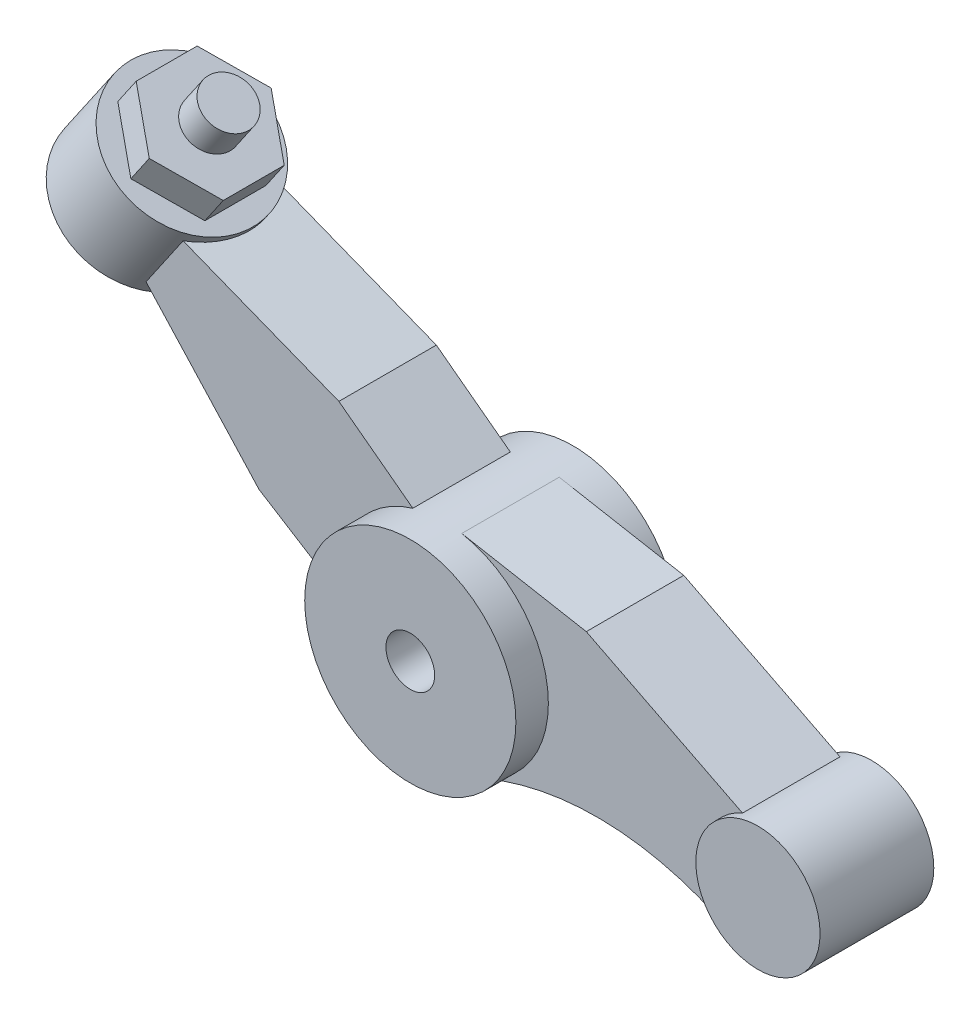
ISO-10303-21;
HEADER;
FILE_DESCRIPTION(('STEP AP214'),'2;1');
FILE_NAME('part.step','',(''),(''),'','','');
FILE_SCHEMA(('AUTOMOTIVE_DESIGN { 1 0 10303 214 1 1 1 1 }'));
ENDSEC;
DATA;
#1=APPLICATION_CONTEXT('core data for automotive mechanical design processes');
#2=APPLICATION_PROTOCOL_DEFINITION('international standard','automotive_design',2000,#1);
#3=PRODUCT_CONTEXT('',#1,'mechanical');
#4=PRODUCT('Part','Part','',(#3));
#5=PRODUCT_RELATED_PRODUCT_CATEGORY('part','',(#4));
#6=PRODUCT_DEFINITION_FORMATION('','',#4);
#7=PRODUCT_DEFINITION_CONTEXT('part definition',#1,'design');
#8=PRODUCT_DEFINITION('design','',#6,#7);
#9=PRODUCT_DEFINITION_SHAPE('','',#8);
#10=(LENGTH_UNIT() NAMED_UNIT(*) SI_UNIT(.MILLI.,.METRE.));
#11=(NAMED_UNIT(*) PLANE_ANGLE_UNIT() SI_UNIT($,.RADIAN.));
#12=(NAMED_UNIT(*) SI_UNIT($,.STERADIAN.) SOLID_ANGLE_UNIT());
#13=UNCERTAINTY_MEASURE_WITH_UNIT(LENGTH_MEASURE(1.E-05),#10,'distance_accuracy_value','');
#14=(GEOMETRIC_REPRESENTATION_CONTEXT(3) GLOBAL_UNCERTAINTY_ASSIGNED_CONTEXT((#13)) GLOBAL_UNIT_ASSIGNED_CONTEXT((#10,
#11,#12)) REPRESENTATION_CONTEXT('',''));
#15=CARTESIAN_POINT('',(0.,0.,0.));
#16=DIRECTION('',(0.,0.,1.));
#17=DIRECTION('',(1.,0.,0.));
#18=AXIS2_PLACEMENT_3D('',#15,#16,#17);
#19=CARTESIAN_POINT('',(0.,0.,1.));
#20=DIRECTION('',(0.,0.,-1.));
#21=DIRECTION('',(-1.,0.,0.));
#22=AXIS2_PLACEMENT_3D('',#19,#20,#21);
#23=CYLINDRICAL_SURFACE('',#22,0.3);
#24=CARTESIAN_POINT('',(0.,0.,1.));
#25=DIRECTION('',(0.,0.,1.));
#26=DIRECTION('',(1.,0.,0.));
#27=AXIS2_PLACEMENT_3D('',#24,#25,#26);
#28=CIRCLE('',#27,0.3);
#29=CARTESIAN_POINT('',(0.3,0.,1.));
#30=VERTEX_POINT('',#29);
#31=EDGE_CURVE('E280',#30,#30,#28,.T.);
#32=ORIENTED_EDGE('',*,*,#31,.T.);
#33=EDGE_LOOP('',(#32));
#34=FACE_BOUND('',#33,.T.);
#35=CARTESIAN_POINT('',(0.,0.,-1.));
#36=DIRECTION('',(0.,0.,1.));
#37=DIRECTION('',(1.,0.,0.));
#38=AXIS2_PLACEMENT_3D('',#35,#36,#37);
#39=CIRCLE('',#38,0.3);
#40=CARTESIAN_POINT('',(0.3,0.,-1.));
#41=VERTEX_POINT('',#40);
#42=EDGE_CURVE('E279',#41,#41,#39,.T.);
#43=ORIENTED_EDGE('',*,*,#42,.F.);
#44=EDGE_LOOP('',(#43));
#45=FACE_BOUND('',#44,.T.);
#46=ADVANCED_FACE('F37',(#34,#45),#23,.F.);
#47=CARTESIAN_POINT('',(0.,0.,1.));
#48=DIRECTION('',(0.,0.,-1.));
#49=DIRECTION('',(-1.,0.,0.));
#50=AXIS2_PLACEMENT_3D('',#47,#48,#49);
#51=CYLINDRICAL_SURFACE('',#50,1.3);
#52=DIRECTION('',(0.,0.,-1.));
#53=VECTOR('',#52,1.);
#54=CARTESIAN_POINT('',(-0.368782160994087,1.24659525016444,0.6));
#55=LINE('',#54,#53);
#56=CARTESIAN_POINT('',(-0.368782160994086,1.24659525016444,0.6));
#57=VERTEX_POINT('',#56);
#58=CARTESIAN_POINT('',(-0.368782160994086,1.24659525016444,-0.6));
#59=VERTEX_POINT('',#58);
#60=EDGE_CURVE('E231',#57,#59,#55,.T.);
#61=ORIENTED_EDGE('',*,*,#60,.F.);
#62=CARTESIAN_POINT('',(0.,0.,0.6));
#63=DIRECTION('',(0.,0.,1.));
#64=DIRECTION('',(1.,0.,0.));
#65=AXIS2_PLACEMENT_3D('',#62,#63,#64);
#66=CIRCLE('',#65,1.3);
#67=CARTESIAN_POINT('',(-1.29584863415519,-0.103809042756995,0.6));
#68=VERTEX_POINT('',#67);
#69=EDGE_CURVE('E199',#57,#68,#66,.T.);
#70=ORIENTED_EDGE('',*,*,#69,.T.);
#71=DIRECTION('',(0.,0.,-1.));
#72=VECTOR('',#71,1.);
#73=CARTESIAN_POINT('',(-1.29584863415519,-0.103809042756996,0.6));
#74=LINE('',#73,#72);
#75=CARTESIAN_POINT('',(-1.29584863415519,-0.103809042756996,-0.6));
#76=VERTEX_POINT('',#75);
#77=EDGE_CURVE('E212',#68,#76,#74,.T.);
#78=ORIENTED_EDGE('',*,*,#77,.T.);
#79=CARTESIAN_POINT('',(0.,0.,-0.6));
#80=DIRECTION('',(0.,0.,1.));
#81=DIRECTION('',(1.,0.,0.));
#82=AXIS2_PLACEMENT_3D('',#79,#80,#81);
#83=CIRCLE('',#82,1.3);
#84=EDGE_CURVE('E198',#59,#76,#83,.T.);
#85=ORIENTED_EDGE('',*,*,#84,.F.);
#86=EDGE_LOOP('',(#61,#70,#78,#85));
#87=FACE_BOUND('',#86,.T.);
#88=DIRECTION('',(0.,0.,-1.));
#89=VECTOR('',#88,1.);
#90=CARTESIAN_POINT('',(0.510625375488259,-1.19551734655231,0.6));
#91=LINE('',#90,#89);
#92=CARTESIAN_POINT('',(0.510625375488259,-1.19551734655231,0.6));
#93=VERTEX_POINT('',#92);
#94=CARTESIAN_POINT('',(0.510625375488259,-1.19551734655231,-0.6));
#95=VERTEX_POINT('',#94);
#96=EDGE_CURVE('E254',#93,#95,#91,.T.);
#97=ORIENTED_EDGE('',*,*,#96,.F.);
#98=CARTESIAN_POINT('',(0.,0.,0.6));
#99=DIRECTION('',(0.,0.,1.));
#100=DIRECTION('',(1.,0.,0.));
#101=AXIS2_PLACEMENT_3D('',#98,#99,#100);
#102=CIRCLE('',#101,1.3);
#103=CARTESIAN_POINT('',(0.233288639489459,1.2788965598066,0.6));
#104=VERTEX_POINT('',#103);
#105=EDGE_CURVE('E252',#93,#104,#102,.T.);
#106=ORIENTED_EDGE('',*,*,#105,.T.);
#107=DIRECTION('',(0.,0.,-1.));
#108=VECTOR('',#107,1.);
#109=CARTESIAN_POINT('',(0.233288639489459,1.2788965598066,0.6));
#110=LINE('',#109,#108);
#111=CARTESIAN_POINT('',(0.233288639489459,1.2788965598066,-0.6));
#112=VERTEX_POINT('',#111);
#113=EDGE_CURVE('E269',#104,#112,#110,.T.);
#114=ORIENTED_EDGE('',*,*,#113,.T.);
#115=CARTESIAN_POINT('',(0.,0.,-0.6));
#116=DIRECTION('',(0.,0.,1.));
#117=DIRECTION('',(1.,0.,0.));
#118=AXIS2_PLACEMENT_3D('',#115,#116,#117);
#119=CIRCLE('',#118,1.3);
#120=EDGE_CURVE('E245',#95,#112,#119,.T.);
#121=ORIENTED_EDGE('',*,*,#120,.F.);
#122=EDGE_LOOP('',(#97,#106,#114,#121));
#123=FACE_BOUND('',#122,.T.);
#124=CARTESIAN_POINT('',(0.,0.,1.));
#125=DIRECTION('',(0.,0.,1.));
#126=DIRECTION('',(1.,0.,0.));
#127=AXIS2_PLACEMENT_3D('',#124,#125,#126);
#128=CIRCLE('',#127,1.3);
#129=CARTESIAN_POINT('',(1.3,0.,1.));
#130=VERTEX_POINT('',#129);
#131=EDGE_CURVE('E283',#130,#130,#128,.T.);
#132=ORIENTED_EDGE('',*,*,#131,.F.);
#133=EDGE_LOOP('',(#132));
#134=FACE_BOUND('',#133,.T.);
#135=CARTESIAN_POINT('',(0.,0.,-1.));
#136=DIRECTION('',(0.,0.,1.));
#137=DIRECTION('',(1.,0.,0.));
#138=AXIS2_PLACEMENT_3D('',#135,#136,#137);
#139=CIRCLE('',#138,1.3);
#140=CARTESIAN_POINT('',(1.3,0.,-1.));
#141=VERTEX_POINT('',#140);
#142=EDGE_CURVE('E284',#141,#141,#139,.T.);
#143=ORIENTED_EDGE('',*,*,#142,.T.);
#144=EDGE_LOOP('',(#143));
#145=FACE_BOUND('',#144,.T.);
#146=ADVANCED_FACE('F307',(#87,#123,#134,#145),#51,.T.);
#147=CARTESIAN_POINT('',(0.,0.,1.));
#148=DIRECTION('',(0.,0.,1.));
#149=DIRECTION('',(1.,0.,0.));
#150=AXIS2_PLACEMENT_3D('',#147,#148,#149);
#151=PLANE('',#150);
#152=ORIENTED_EDGE('',*,*,#31,.F.);
#153=EDGE_LOOP('',(#152));
#154=FACE_BOUND('',#153,.T.);
#155=ORIENTED_EDGE('',*,*,#131,.T.);
#156=EDGE_LOOP('',(#155));
#157=FACE_BOUND('',#156,.T.);
#158=ADVANCED_FACE('F338',(#154,#157),#151,.T.);
#159=CARTESIAN_POINT('',(0.,0.,-1.));
#160=DIRECTION('',(0.,0.,1.));
#161=DIRECTION('',(1.,0.,0.));
#162=AXIS2_PLACEMENT_3D('',#159,#160,#161);
#163=PLANE('',#162);
#164=ORIENTED_EDGE('',*,*,#42,.T.);
#165=EDGE_LOOP('',(#164));
#166=FACE_BOUND('',#165,.T.);
#167=ORIENTED_EDGE('',*,*,#142,.F.);
#168=EDGE_LOOP('',(#167));
#169=FACE_BOUND('',#168,.T.);
#170=ADVANCED_FACE('F343',(#166,#169),#163,.F.);
#171=CARTESIAN_POINT('',(1.90085393647688,-4.45043267218632,0.6));
#172=DIRECTION('',(0.,0.,-1.));
#173=DIRECTION('',(-1.,0.,0.));
#174=AXIS2_PLACEMENT_3D('',#171,#172,#173);
#175=CYLINDRICAL_SURFACE('',#174,3.53937978024903);
#176=CARTESIAN_POINT('',(1.90085393647688,-4.45043267218632,-0.6));
#177=DIRECTION('',(0.,0.,1.));
#178=DIRECTION('',(1.,0.,0.));
#179=AXIS2_PLACEMENT_3D('',#176,#177,#178);
#180=CIRCLE('',#179,3.53937978024903);
#181=CARTESIAN_POINT('',(3.59011599949996,-1.34019105596634,-0.6));
#182=VERTEX_POINT('',#181);
#183=EDGE_CURVE('E238',#182,#95,#180,.T.);
#184=ORIENTED_EDGE('',*,*,#183,.F.);
#185=DIRECTION('',(0.,0.,-1.));
#186=VECTOR('',#185,1.);
#187=CARTESIAN_POINT('',(3.59011599949996,-1.34019105596634,0.6));
#188=LINE('',#187,#186);
#189=CARTESIAN_POINT('',(3.59011599949994,-1.34019105596633,0.6));
#190=VERTEX_POINT('',#189);
#191=EDGE_CURVE('E277',#190,#182,#188,.T.);
#192=ORIENTED_EDGE('',*,*,#191,.F.);
#193=CARTESIAN_POINT('',(1.90085393647688,-4.45043267218632,0.6));
#194=DIRECTION('',(0.,0.,1.));
#195=DIRECTION('',(1.,0.,0.));
#196=AXIS2_PLACEMENT_3D('',#193,#194,#195);
#197=CIRCLE('',#196,3.53937978024903);
#198=EDGE_CURVE('E241',#190,#93,#197,.T.);
#199=ORIENTED_EDGE('',*,*,#198,.T.);
#200=ORIENTED_EDGE('',*,*,#96,.T.);
#201=EDGE_LOOP('',(#184,#192,#199,#200));
#202=FACE_BOUND('',#201,.T.);
#203=ADVANCED_FACE('F346',(#202),#175,.F.);
#204=CARTESIAN_POINT('',(0.76254825738098,1.50721358110787,0.6));
#205=DIRECTION('',(-0.451443400680883,-0.89229975679795,0.));
#206=DIRECTION('',(0.89229975679795,-0.451443400680883,0.));
#207=AXIS2_PLACEMENT_3D('',#204,#205,#206);
#208=PLANE('',#207);
#209=DIRECTION('',(-0.89229975679795,0.451443400680883,0.));
#210=VECTOR('',#209,1.);
#211=CARTESIAN_POINT('',(0.76254825738098,1.50721358110787,-0.6));
#212=LINE('',#211,#210);
#213=CARTESIAN_POINT('',(3.69023915754047,0.0259997557747794,-0.6));
#214=VERTEX_POINT('',#213);
#215=CARTESIAN_POINT('',(1.76669930267283,0.999180984180394,-0.6));
#216=VERTEX_POINT('',#215);
#217=EDGE_CURVE('E260',#214,#216,#212,.T.);
#218=ORIENTED_EDGE('',*,*,#217,.T.);
#219=DIRECTION('',(0.,0.,-1.));
#220=VECTOR('',#219,1.);
#221=CARTESIAN_POINT('',(1.76669930267283,0.999180984180394,0.6));
#222=LINE('',#221,#220);
#223=CARTESIAN_POINT('',(1.76669930267283,0.999180984180394,0.6));
#224=VERTEX_POINT('',#223);
#225=EDGE_CURVE('E271',#224,#216,#222,.T.);
#226=ORIENTED_EDGE('',*,*,#225,.F.);
#227=DIRECTION('',(-0.89229975679795,0.451443400680883,0.));
#228=VECTOR('',#227,1.);
#229=CARTESIAN_POINT('',(0.76254825738098,1.50721358110787,0.6));
#230=LINE('',#229,#228);
#231=CARTESIAN_POINT('',(3.69023915754047,0.0259997557747791,0.6));
#232=VERTEX_POINT('',#231);
#233=EDGE_CURVE('E247',#232,#224,#230,.T.);
#234=ORIENTED_EDGE('',*,*,#233,.F.);
#235=DIRECTION('',(0.,0.,-1.));
#236=VECTOR('',#235,1.);
#237=CARTESIAN_POINT('',(3.69023915754047,0.0259997557747792,0.6));
#238=LINE('',#237,#236);
#239=EDGE_CURVE('E274',#232,#214,#238,.T.);
#240=ORIENTED_EDGE('',*,*,#239,.T.);
#241=EDGE_LOOP('',(#218,#226,#234,#240));
#242=FACE_BOUND('',#241,.T.);
#243=ADVANCED_FACE('F354',(#242),#208,.F.);
#244=CARTESIAN_POINT('',(0.233288639489459,1.2788965598066,0.6));
#245=DIRECTION('',(-0.179452799607276,-0.983766584466616,0.));
#246=DIRECTION('',(0.983766584466616,-0.179452799607276,0.));
#247=AXIS2_PLACEMENT_3D('',#244,#245,#246);
#248=PLANE('',#247);
#249=DIRECTION('',(-0.983766584466616,0.179452799607276,0.));
#250=VECTOR('',#249,1.);
#251=CARTESIAN_POINT('',(0.233288639489459,1.2788965598066,-0.6));
#252=LINE('',#251,#250);
#253=EDGE_CURVE('E262',#216,#112,#252,.T.);
#254=ORIENTED_EDGE('',*,*,#253,.T.);
#255=ORIENTED_EDGE('',*,*,#113,.F.);
#256=DIRECTION('',(-0.983766584466616,0.179452799607276,0.));
#257=VECTOR('',#256,1.);
#258=CARTESIAN_POINT('',(0.233288639489459,1.2788965598066,0.6));
#259=LINE('',#258,#257);
#260=EDGE_CURVE('E249',#224,#104,#259,.T.);
#261=ORIENTED_EDGE('',*,*,#260,.F.);
#262=ORIENTED_EDGE('',*,*,#225,.T.);
#263=EDGE_LOOP('',(#254,#255,#261,#262));
#264=FACE_BOUND('',#263,.T.);
#265=ADVANCED_FACE('F362',(#264),#248,.F.);
#266=CARTESIAN_POINT('',(0.,0.,0.6));
#267=DIRECTION('',(0.,0.,1.));
#268=DIRECTION('',(1.,0.,0.));
#269=AXIS2_PLACEMENT_3D('',#266,#267,#268);
#270=PLANE('',#269);
#271=ORIENTED_EDGE('',*,*,#198,.F.);
#272=CARTESIAN_POINT('',(3.98,-0.682,0.6));
#273=DIRECTION('',(0.,0.,1.));
#274=DIRECTION('',(1.,0.,0.));
#275=AXIS2_PLACEMENT_3D('',#272,#273,#274);
#276=CIRCLE('',#275,0.765);
#277=EDGE_CURVE('E244',#232,#190,#276,.T.);
#278=ORIENTED_EDGE('',*,*,#277,.F.);
#279=ORIENTED_EDGE('',*,*,#233,.T.);
#280=ORIENTED_EDGE('',*,*,#260,.T.);
#281=ORIENTED_EDGE('',*,*,#105,.F.);
#282=EDGE_LOOP('',(#271,#278,#279,#280,#281));
#283=FACE_BOUND('',#282,.T.);
#284=ADVANCED_FACE('F366',(#283),#270,.T.);
#285=CARTESIAN_POINT('',(0.,0.,-0.6));
#286=DIRECTION('',(0.,0.,1.));
#287=DIRECTION('',(1.,0.,0.));
#288=AXIS2_PLACEMENT_3D('',#285,#286,#287);
#289=PLANE('',#288);
#290=ORIENTED_EDGE('',*,*,#183,.T.);
#291=ORIENTED_EDGE('',*,*,#120,.T.);
#292=ORIENTED_EDGE('',*,*,#253,.F.);
#293=ORIENTED_EDGE('',*,*,#217,.F.);
#294=CARTESIAN_POINT('',(3.98,-0.682,-0.6));
#295=DIRECTION('',(0.,0.,1.));
#296=DIRECTION('',(1.,0.,0.));
#297=AXIS2_PLACEMENT_3D('',#294,#295,#296);
#298=CIRCLE('',#297,0.765);
#299=EDGE_CURVE('E257',#214,#182,#298,.T.);
#300=ORIENTED_EDGE('',*,*,#299,.T.);
#301=EDGE_LOOP('',(#290,#291,#292,#293,#300));
#302=FACE_BOUND('',#301,.T.);
#303=ADVANCED_FACE('F368',(#302),#289,.F.);
#304=CARTESIAN_POINT('',(3.98,-0.682,0.7));
#305=DIRECTION('',(0.,0.,-1.));
#306=DIRECTION('',(-1.,0.,0.));
#307=AXIS2_PLACEMENT_3D('',#304,#305,#306);
#308=CYLINDRICAL_SURFACE('',#307,0.765);
#309=ORIENTED_EDGE('',*,*,#277,.T.);
#310=ORIENTED_EDGE('',*,*,#191,.T.);
#311=ORIENTED_EDGE('',*,*,#299,.F.);
#312=ORIENTED_EDGE('',*,*,#239,.F.);
#313=EDGE_LOOP('',(#309,#310,#311,#312));
#314=FACE_BOUND('',#313,.T.);
#315=CARTESIAN_POINT('',(3.98,-0.682,0.7));
#316=DIRECTION('',(0.,0.,1.));
#317=DIRECTION('',(1.,0.,0.));
#318=AXIS2_PLACEMENT_3D('',#315,#316,#317);
#319=CIRCLE('',#318,0.765);
#320=CARTESIAN_POINT('',(4.745,-0.682,0.7));
#321=VERTEX_POINT('',#320);
#322=EDGE_CURVE('E235',#321,#321,#319,.T.);
#323=ORIENTED_EDGE('',*,*,#322,.F.);
#324=EDGE_LOOP('',(#323));
#325=FACE_BOUND('',#324,.T.);
#326=CARTESIAN_POINT('',(3.98,-0.682,-0.7));
#327=DIRECTION('',(0.,0.,1.));
#328=DIRECTION('',(1.,0.,0.));
#329=AXIS2_PLACEMENT_3D('',#326,#327,#328);
#330=CIRCLE('',#329,0.765);
#331=CARTESIAN_POINT('',(4.745,-0.682,-0.7));
#332=VERTEX_POINT('',#331);
#333=EDGE_CURVE('E234',#332,#332,#330,.T.);
#334=ORIENTED_EDGE('',*,*,#333,.T.);
#335=EDGE_LOOP('',(#334));
#336=FACE_BOUND('',#335,.T.);
#337=ADVANCED_FACE('F371',(#314,#325,#336),#308,.T.);
#338=CARTESIAN_POINT('',(0.,0.,0.7));
#339=DIRECTION('',(0.,0.,1.));
#340=DIRECTION('',(1.,0.,0.));
#341=AXIS2_PLACEMENT_3D('',#338,#339,#340);
#342=PLANE('',#341);
#343=ORIENTED_EDGE('',*,*,#322,.T.);
#344=EDGE_LOOP('',(#343));
#345=FACE_BOUND('',#344,.T.);
#346=ADVANCED_FACE('F378',(#345),#342,.T.);
#347=CARTESIAN_POINT('',(0.,0.,-0.7));
#348=DIRECTION('',(0.,0.,1.));
#349=DIRECTION('',(1.,0.,0.));
#350=AXIS2_PLACEMENT_3D('',#347,#348,#349);
#351=PLANE('',#350);
#352=ORIENTED_EDGE('',*,*,#333,.F.);
#353=EDGE_LOOP('',(#352));
#354=FACE_BOUND('',#353,.T.);
#355=ADVANCED_FACE('F380',(#354),#351,.F.);
#356=CARTESIAN_POINT('',(0.465596939300394,0.61935121914691,0.6));
#357=DIRECTION('',(0.600894591635021,0.799328274080043,0.));
#358=DIRECTION('',(-0.799328274080043,0.600894591635021,0.));
#359=AXIS2_PLACEMENT_3D('',#356,#357,#358);
#360=PLANE('',#359);
#361=DIRECTION('',(0.799328274080043,-0.600894591635021,0.));
#362=VECTOR('',#361,1.);
#363=CARTESIAN_POINT('',(0.465596939300394,0.61935121914691,-0.6));
#364=LINE('',#363,#362);
#365=CARTESIAN_POINT('',(-1.27933825815641,1.93110529679684,-0.6));
#366=VERTEX_POINT('',#365);
#367=EDGE_CURVE('E215',#366,#59,#364,.T.);
#368=ORIENTED_EDGE('',*,*,#367,.F.);
#369=DIRECTION('',(0.,0.,-1.));
#370=VECTOR('',#369,1.);
#371=CARTESIAN_POINT('',(-1.27933825815641,1.93110529679684,0.6));
#372=LINE('',#371,#370);
#373=CARTESIAN_POINT('',(-1.27933825815641,1.93110529679684,0.6));
#374=VERTEX_POINT('',#373);
#375=EDGE_CURVE('E228',#374,#366,#372,.T.);
#376=ORIENTED_EDGE('',*,*,#375,.F.);
#377=DIRECTION('',(0.799328274080043,-0.600894591635021,0.));
#378=VECTOR('',#377,1.);
#379=CARTESIAN_POINT('',(0.465596939300394,0.61935121914691,0.6));
#380=LINE('',#379,#378);
#381=EDGE_CURVE('E201',#374,#57,#380,.T.);
#382=ORIENTED_EDGE('',*,*,#381,.T.);
#383=ORIENTED_EDGE('',*,*,#60,.T.);
#384=EDGE_LOOP('',(#368,#376,#382,#383));
#385=FACE_BOUND('',#384,.T.);
#386=ADVANCED_FACE('F305',(#385),#360,.T.);
#387=CARTESIAN_POINT('',(0.48609644058924,1.23780325661851,0.6));
#388=DIRECTION('',(0.365532889456459,0.930798424324844,0.));
#389=DIRECTION('',(-0.930798424324844,0.365532889456459,0.));
#390=AXIS2_PLACEMENT_3D('',#387,#388,#389);
#391=PLANE('',#390);
#392=CARTESIAN_POINT('',(-3.85033692345561,2.94075953165139,0.));
#393=DIRECTION('',(0.365532889456459,0.930798424324844,0.));
#394=DIRECTION('',(0.930798424324844,-0.365532889456459,0.));
#395=AXIS2_PLACEMENT_3D('',#392,#393,#394);
#396=ELLIPSE('',#395,0.934048337697044,0.91);
#397=CARTESIAN_POINT('',(-3.19667540338443,2.68406079010439,0.6));
#398=VERTEX_POINT('',#397);
#399=CARTESIAN_POINT('',(-3.19667540338444,2.68406079010439,-0.6));
#400=VERTEX_POINT('',#399);
#401=EDGE_CURVE('E194',#398,#400,#396,.T.);
#402=ORIENTED_EDGE('',*,*,#401,.F.);
#403=DIRECTION('',(0.930798424324844,-0.365532889456459,0.));
#404=VECTOR('',#403,1.);
#405=CARTESIAN_POINT('',(0.48609644058924,1.23780325661851,0.6));
#406=LINE('',#405,#404);
#407=EDGE_CURVE('E205',#398,#374,#406,.T.);
#408=ORIENTED_EDGE('',*,*,#407,.T.);
#409=ORIENTED_EDGE('',*,*,#375,.T.);
#410=DIRECTION('',(0.930798424324844,-0.365532889456459,0.));
#411=VECTOR('',#410,1.);
#412=CARTESIAN_POINT('',(0.48609644058924,1.23780325661851,-0.6));
#413=LINE('',#412,#411);
#414=EDGE_CURVE('E218',#400,#366,#413,.T.);
#415=ORIENTED_EDGE('',*,*,#414,.F.);
#416=EDGE_LOOP('',(#402,#408,#409,#415));
#417=FACE_BOUND('',#416,.T.);
#418=ADVANCED_FACE('F299',(#417),#391,.T.);
#419=CARTESIAN_POINT('',(-0.980447215425116,-0.898426351691699,0.6));
#420=DIRECTION('',(0.737272840713361,0.675595114211502,0.));
#421=DIRECTION('',(-0.675595114211502,0.737272840713361,0.));
#422=AXIS2_PLACEMENT_3D('',#419,#420,#421);
#423=PLANE('',#422);
#424=DIRECTION('',(0.675595114211502,-0.737272840713361,0.));
#425=VECTOR('',#424,1.);
#426=CARTESIAN_POINT('',(-0.980447215425116,-0.898426351691699,0.6));
#427=LINE('',#426,#425);
#428=CARTESIAN_POINT('',(-3.65348855232791,2.0186474079412,0.6));
#429=VERTEX_POINT('',#428);
#430=CARTESIAN_POINT('',(-2.26184072207738,0.49995059161078,0.6));
#431=VERTEX_POINT('',#430);
#432=EDGE_CURVE('E207',#429,#431,#427,.T.);
#433=ORIENTED_EDGE('',*,*,#432,.F.);
#434=CARTESIAN_POINT('',(-4.12793126491466,2.53640385571071,0.));
#435=DIRECTION('',(0.737272840713361,0.675595114211502,0.));
#436=DIRECTION('',(-0.675595114211502,0.737272840713361,0.));
#437=AXIS2_PLACEMENT_3D('',#434,#435,#436);
#438=ELLIPSE('',#437,0.934048337697044,0.91);
#439=CARTESIAN_POINT('',(-3.65348855232791,2.0186474079412,-0.6));
#440=VERTEX_POINT('',#439);
#441=EDGE_CURVE('E191',#429,#440,#438,.T.);
#442=ORIENTED_EDGE('',*,*,#441,.T.);
#443=DIRECTION('',(0.675595114211502,-0.737272840713361,0.));
#444=VECTOR('',#443,1.);
#445=CARTESIAN_POINT('',(-0.980447215425116,-0.898426351691699,-0.6));
#446=LINE('',#445,#444);
#447=CARTESIAN_POINT('',(-2.26184072207738,0.49995059161078,-0.6));
#448=VERTEX_POINT('',#447);
#449=EDGE_CURVE('E220',#440,#448,#446,.T.);
#450=ORIENTED_EDGE('',*,*,#449,.T.);
#451=DIRECTION('',(0.,0.,-1.));
#452=VECTOR('',#451,1.);
#453=CARTESIAN_POINT('',(-2.26184072207738,0.49995059161078,0.6));
#454=LINE('',#453,#452);
#455=EDGE_CURVE('E225',#431,#448,#454,.T.);
#456=ORIENTED_EDGE('',*,*,#455,.F.);
#457=EDGE_LOOP('',(#433,#442,#450,#456));
#458=FACE_BOUND('',#457,.T.);
#459=ADVANCED_FACE('F317',(#458),#423,.F.);
#460=CARTESIAN_POINT('',(-0.41067131040331,-0.657058229806374,0.6));
#461=DIRECTION('',(0.53000814337786,0.847992551826461,0.));
#462=DIRECTION('',(-0.847992551826461,0.53000814337786,0.));
#463=AXIS2_PLACEMENT_3D('',#460,#461,#462);
#464=PLANE('',#463);
#465=DIRECTION('',(0.847992551826461,-0.53000814337786,0.));
#466=VECTOR('',#465,1.);
#467=CARTESIAN_POINT('',(-0.41067131040331,-0.657058229806374,-0.6));
#468=LINE('',#467,#466);
#469=EDGE_CURVE('E202',#448,#76,#468,.T.);
#470=ORIENTED_EDGE('',*,*,#469,.T.);
#471=ORIENTED_EDGE('',*,*,#77,.F.);
#472=DIRECTION('',(0.847992551826461,-0.53000814337786,0.));
#473=VECTOR('',#472,1.);
#474=CARTESIAN_POINT('',(-0.41067131040331,-0.657058229806374,0.6));
#475=LINE('',#474,#473);
#476=EDGE_CURVE('E209',#431,#68,#475,.T.);
#477=ORIENTED_EDGE('',*,*,#476,.F.);
#478=ORIENTED_EDGE('',*,*,#455,.T.);
#479=EDGE_LOOP('',(#470,#471,#477,#478));
#480=FACE_BOUND('',#479,.T.);
#481=ADVANCED_FACE('F313',(#480),#464,.F.);
#482=CARTESIAN_POINT('',(0.,0.,0.6));
#483=DIRECTION('',(0.,0.,1.));
#484=DIRECTION('',(1.,0.,0.));
#485=AXIS2_PLACEMENT_3D('',#482,#483,#484);
#486=PLANE('',#485);
#487=DIRECTION('',(0.565974647839503,0.824422645251179,0.));
#488=VECTOR('',#487,1.);
#489=CARTESIAN_POINT('',(-3.12564726413748,2.78752338629801,0.6));
#490=LINE('',#489,#488);
#491=EDGE_CURVE('E196',#429,#398,#490,.T.);
#492=ORIENTED_EDGE('',*,*,#491,.F.);
#493=ORIENTED_EDGE('',*,*,#432,.T.);
#494=ORIENTED_EDGE('',*,*,#476,.T.);
#495=ORIENTED_EDGE('',*,*,#69,.F.);
#496=ORIENTED_EDGE('',*,*,#381,.F.);
#497=ORIENTED_EDGE('',*,*,#407,.F.);
#498=EDGE_LOOP('',(#492,#493,#494,#495,#496,#497));
#499=FACE_BOUND('',#498,.T.);
#500=ADVANCED_FACE('F322',(#499),#486,.T.);
#501=CARTESIAN_POINT('',(0.,0.,-0.6));
#502=DIRECTION('',(0.,0.,1.));
#503=DIRECTION('',(1.,0.,0.));
#504=AXIS2_PLACEMENT_3D('',#501,#502,#503);
#505=PLANE('',#504);
#506=ORIENTED_EDGE('',*,*,#449,.F.);
#507=DIRECTION('',(0.565974647839503,0.824422645251179,0.));
#508=VECTOR('',#507,1.);
#509=CARTESIAN_POINT('',(-3.12564726413748,2.78752338629801,-0.6));
#510=LINE('',#509,#508);
#511=EDGE_CURVE('E45',#440,#400,#510,.T.);
#512=ORIENTED_EDGE('',*,*,#511,.T.);
#513=ORIENTED_EDGE('',*,*,#414,.T.);
#514=ORIENTED_EDGE('',*,*,#367,.T.);
#515=ORIENTED_EDGE('',*,*,#84,.T.);
#516=ORIENTED_EDGE('',*,*,#469,.F.);
#517=EDGE_LOOP('',(#506,#512,#513,#514,#515,#516));
#518=FACE_BOUND('',#517,.T.);
#519=ADVANCED_FACE('F294',(#518),#505,.F.);
#520=CARTESIAN_POINT('',(-4.43992398764502,3.68978791049021,0.));
#521=DIRECTION('',(0.565974647839503,0.824422645251179,0.));
#522=DIRECTION('',(-0.824422645251179,0.565974647839503,0.));
#523=AXIS2_PLACEMENT_3D('',#520,#521,#522);
#524=PLANE('',#523);
#525=DIRECTION('',(-0.713970954242687,0.490148422926961,-0.5));
#526=VECTOR('',#525,1.);
#527=CARTESIAN_POINT('',(-3.15382466105318,2.80686745986058,-0.375277674973257));
#528=LINE('',#527,#526);
#529=CARTESIAN_POINT('',(-3.15382466105318,2.80686745986058,-0.375277674973257));
#530=VERTEX_POINT('',#529);
#531=CARTESIAN_POINT('',(-3.68969938046644,3.17475098095626,-0.750555349946514));
#532=VERTEX_POINT('',#531);
#533=EDGE_CURVE('E53',#530,#532,#528,.T.);
#534=ORIENTED_EDGE('',*,*,#533,.F.);
#535=DIRECTION('',(0.,0.,-1.));
#536=VECTOR('',#535,1.);
#537=CARTESIAN_POINT('',(-3.15382466105318,2.80686745986058,0.375277674973256));
#538=LINE('',#537,#536);
#539=CARTESIAN_POINT('',(-3.15382466105318,2.80686745986058,0.375277674973256));
#540=VERTEX_POINT('',#539);
#541=EDGE_CURVE('E57',#540,#530,#538,.T.);
#542=ORIENTED_EDGE('',*,*,#541,.F.);
#543=DIRECTION('',(0.713970954242688,-0.49014842292696,-0.5));
#544=VECTOR('',#543,1.);
#545=CARTESIAN_POINT('',(-3.68969938046644,3.17475098095626,0.750555349946513));
#546=LINE('',#545,#544);
#547=CARTESIAN_POINT('',(-3.68969938046644,3.17475098095626,0.750555349946513));
#548=VERTEX_POINT('',#547);
#549=EDGE_CURVE('E617',#548,#540,#546,.T.);
#550=ORIENTED_EDGE('',*,*,#549,.F.);
#551=DIRECTION('',(0.713970954242687,-0.490148422926961,0.5));
#552=VECTOR('',#551,1.);
#553=CARTESIAN_POINT('',(-4.22557409987971,3.54263450205194,0.375277674973256));
#554=LINE('',#553,#552);
#555=CARTESIAN_POINT('',(-4.22557409987971,3.54263450205194,0.375277674973256));
#556=VERTEX_POINT('',#555);
#557=EDGE_CURVE('E614',#556,#548,#554,.T.);
#558=ORIENTED_EDGE('',*,*,#557,.F.);
#559=DIRECTION('',(0.,0.,1.));
#560=VECTOR('',#559,1.);
#561=CARTESIAN_POINT('',(-4.22557409987971,3.54263450205194,-0.375277674973258));
#562=LINE('',#561,#560);
#563=CARTESIAN_POINT('',(-4.22557409987971,3.54263450205194,-0.375277674973258));
#564=VERTEX_POINT('',#563);
#565=EDGE_CURVE('E611',#564,#556,#562,.T.);
#566=ORIENTED_EDGE('',*,*,#565,.F.);
#567=DIRECTION('',(-0.713970954242687,0.490148422926961,0.5));
#568=VECTOR('',#567,1.);
#569=CARTESIAN_POINT('',(-3.68969938046644,3.17475098095626,-0.750555349946514));
#570=LINE('',#569,#568);
#571=EDGE_CURVE('E600',#532,#564,#570,.T.);
#572=ORIENTED_EDGE('',*,*,#571,.F.);
#573=EDGE_LOOP('',(#534,#542,#550,#558,#566,#572));
#574=FACE_BOUND('',#573,.T.);
#575=CARTESIAN_POINT('',(-3.68969938046644,3.17475098095626,0.));
#576=DIRECTION('',(0.565974647839503,0.824422645251179,0.));
#577=DIRECTION('',(-0.824422645251179,0.565974647839503,0.));
#578=AXIS2_PLACEMENT_3D('',#575,#576,#577);
#579=CIRCLE('',#578,0.91);
#580=CARTESIAN_POINT('',(-4.43992398764502,3.68978791049021,0.));
#581=VERTEX_POINT('',#580);
#582=EDGE_CURVE('E185',#581,#581,#579,.T.);
#583=ORIENTED_EDGE('',*,*,#582,.T.);
#584=EDGE_LOOP('',(#583));
#585=FACE_BOUND('',#584,.T.);
#586=ADVANCED_FACE('F329',(#574,#585),#524,.T.);
#587=CARTESIAN_POINT('',(-4.30326820536007,2.28100064144299,0.));
#588=DIRECTION('',(-0.565974647839503,-0.824422645251179,0.));
#589=DIRECTION('',(0.824422645251179,-0.565974647839503,0.));
#590=AXIS2_PLACEMENT_3D('',#587,#588,#589);
#591=PLANE('',#590);
#592=CARTESIAN_POINT('',(-4.30021760096438,2.27890637006594,0.));
#593=DIRECTION('',(-0.565974647839503,-0.824422645251179,0.));
#594=DIRECTION('',(0.824422645251179,-0.565974647839503,0.));
#595=AXIS2_PLACEMENT_3D('',#592,#593,#594);
#596=CIRCLE('',#595,0.325511192138222);
#597=CARTESIAN_POINT('',(-4.03185880288292,2.09467528772769,0.));
#598=VERTEX_POINT('',#597);
#599=EDGE_CURVE('E40',#598,#598,#596,.F.);
#600=ORIENTED_EDGE('',*,*,#599,.T.);
#601=EDGE_LOOP('',(#600));
#602=FACE_BOUND('',#601,.T.);
#603=CARTESIAN_POINT('',(-4.30326820536007,2.28100064144299,0.));
#604=DIRECTION('',(0.565974647839503,0.824422645251179,0.));
#605=DIRECTION('',(-0.824422645251179,0.565974647839503,0.));
#606=AXIS2_PLACEMENT_3D('',#603,#604,#605);
#607=CIRCLE('',#606,0.910000000000001);
#608=CARTESIAN_POINT('',(-5.05349281253864,2.79603757097694,0.));
#609=VERTEX_POINT('',#608);
#610=EDGE_CURVE('E188',#609,#609,#607,.T.);
#611=ORIENTED_EDGE('',*,*,#610,.F.);
#612=EDGE_LOOP('',(#611));
#613=FACE_BOUND('',#612,.T.);
#614=ADVANCED_FACE('F464',(#602,#613),#591,.T.);
#615=CARTESIAN_POINT('',(-3.68969938046644,3.17475098095626,0.));
#616=DIRECTION('',(0.565974647839503,0.824422645251179,0.));
#617=DIRECTION('',(-0.824422645251179,0.565974647839503,0.));
#618=AXIS2_PLACEMENT_3D('',#615,#616,#617);
#619=CYLINDRICAL_SURFACE('',#618,0.91);
#620=ORIENTED_EDGE('',*,*,#441,.F.);
#621=ORIENTED_EDGE('',*,*,#491,.T.);
#622=ORIENTED_EDGE('',*,*,#401,.T.);
#623=ORIENTED_EDGE('',*,*,#511,.F.);
#624=EDGE_LOOP('',(#620,#621,#622,#623));
#625=FACE_BOUND('',#624,.T.);
#626=ORIENTED_EDGE('',*,*,#610,.T.);
#627=EDGE_LOOP('',(#626));
#628=FACE_BOUND('',#627,.T.);
#629=ORIENTED_EDGE('',*,*,#582,.F.);
#630=EDGE_LOOP('',(#629));
#631=FACE_BOUND('',#630,.T.);
#632=ADVANCED_FACE('F319',(#625,#628,#631),#619,.T.);
#633=CARTESIAN_POINT('',(-4.48226451871038,2.01372911864505,0.));
#634=DIRECTION('',(0.565974647839502,0.824422645251179,0.));
#635=DIRECTION('',(-0.824422645251179,0.565974647839502,0.));
#636=AXIS2_PLACEMENT_3D('',#633,#634,#635);
#637=CONICAL_SURFACE('',#636,0.222762142850955,0.309196322822295);
#638=ORIENTED_EDGE('',*,*,#599,.F.);
#639=EDGE_LOOP('',(#638));
#640=FACE_BOUND('',#639,.T.);
#641=CARTESIAN_POINT('',(-4.48226451871038,2.01372911864505,0.));
#642=DIRECTION('',(0.565974647839502,0.824422645251179,0.));
#643=DIRECTION('',(-0.824422645251179,0.565974647839502,0.));
#644=AXIS2_PLACEMENT_3D('',#641,#642,#643);
#645=CIRCLE('',#644,0.222762142850955);
#646=CARTESIAN_POINT('',(-4.66591467378139,2.1398068439971,0.));
#647=VERTEX_POINT('',#646);
#648=EDGE_CURVE('E177',#647,#647,#645,.T.);
#649=ORIENTED_EDGE('',*,*,#648,.T.);
#650=EDGE_LOOP('',(#649));
#651=FACE_BOUND('',#650,.T.);
#652=ADVANCED_FACE('F437',(#640,#651),#637,.T.);
#653=CARTESIAN_POINT('',(-4.6350535944478,1.79117007917966,0.));
#654=DIRECTION('',(0.565974647839502,0.824422645251179,0.));
#655=DIRECTION('',(0.824422645251179,-0.565974647839502,0.));
#656=AXIS2_PLACEMENT_3D('',#653,#654,#655);
#657=SPHERICAL_SURFACE('',#656,0.35);
#658=ORIENTED_EDGE('',*,*,#648,.F.);
#659=EDGE_LOOP('',(#658));
#660=FACE_BOUND('',#659,.T.);
#661=ADVANCED_FACE('F442',(#660),#657,.T.);
#662=CARTESIAN_POINT('',(-2.92743480191738,3.13663651796106,-0.375277674973257));
#663=DIRECTION('',(-0.412211322625589,0.282987323919751,0.866025403784439));
#664=DIRECTION('',(0.902934052856613,0.,0.429779124890835));
#665=AXIS2_PLACEMENT_3D('',#662,#663,#664);
#666=PLANE('',#665);
#667=ORIENTED_EDGE('',*,*,#533,.T.);
#668=DIRECTION('',(-0.565974647839503,-0.824422645251179,0.));
#669=VECTOR('',#668,1.);
#670=CARTESIAN_POINT('',(-3.46330952133064,3.50452003905673,-0.750555349946514));
#671=LINE('',#670,#669);
#672=CARTESIAN_POINT('',(-3.46330952133064,3.50452003905673,-0.750555349946514));
#673=VERTEX_POINT('',#672);
#674=EDGE_CURVE('E160',#673,#532,#671,.T.);
#675=ORIENTED_EDGE('',*,*,#674,.F.);
#676=DIRECTION('',(-0.713970954242687,0.490148422926961,-0.5));
#677=VECTOR('',#676,1.);
#678=CARTESIAN_POINT('',(-2.92743480191738,3.13663651796106,-0.375277674973257));
#679=LINE('',#678,#677);
#680=CARTESIAN_POINT('',(-2.92743480191738,3.13663651796106,-0.375277674973257));
#681=VERTEX_POINT('',#680);
#682=EDGE_CURVE('E166',#681,#673,#679,.T.);
#683=ORIENTED_EDGE('',*,*,#682,.F.);
#684=DIRECTION('',(-0.565974647839503,-0.824422645251179,0.));
#685=VECTOR('',#684,1.);
#686=CARTESIAN_POINT('',(-2.92743480191738,3.13663651796106,-0.375277674973257));
#687=LINE('',#686,#685);
#688=EDGE_CURVE('E608',#681,#530,#687,.T.);
#689=ORIENTED_EDGE('',*,*,#688,.T.);
#690=EDGE_LOOP('',(#667,#675,#683,#689));
#691=FACE_BOUND('',#690,.T.);
#692=ADVANCED_FACE('F176',(#691),#666,.F.);
#693=CARTESIAN_POINT('',(-3.46330952133064,3.50452003905673,-0.750555349946514));
#694=DIRECTION('',(0.412211322625589,-0.282987323919751,0.866025403784439));
#695=DIRECTION('',(0.902934052856613,0.,-0.429779124890835));
#696=AXIS2_PLACEMENT_3D('',#693,#694,#695);
#697=PLANE('',#696);
#698=ORIENTED_EDGE('',*,*,#571,.T.);
#699=DIRECTION('',(-0.565974647839503,-0.824422645251179,0.));
#700=VECTOR('',#699,1.);
#701=CARTESIAN_POINT('',(-3.99918424074391,3.87240356015241,-0.375277674973258));
#702=LINE('',#701,#700);
#703=CARTESIAN_POINT('',(-3.99918424074391,3.87240356015241,-0.375277674973258));
#704=VERTEX_POINT('',#703);
#705=EDGE_CURVE('E162',#704,#564,#702,.T.);
#706=ORIENTED_EDGE('',*,*,#705,.F.);
#707=DIRECTION('',(-0.713970954242687,0.490148422926961,0.5));
#708=VECTOR('',#707,1.);
#709=CARTESIAN_POINT('',(-3.46330952133064,3.50452003905673,-0.750555349946514));
#710=LINE('',#709,#708);
#711=EDGE_CURVE('E155',#673,#704,#710,.T.);
#712=ORIENTED_EDGE('',*,*,#711,.F.);
#713=ORIENTED_EDGE('',*,*,#674,.T.);
#714=EDGE_LOOP('',(#698,#706,#712,#713));
#715=FACE_BOUND('',#714,.T.);
#716=ADVANCED_FACE('F158',(#715),#697,.F.);
#717=CARTESIAN_POINT('',(-3.99918424074391,3.87240356015241,-0.375277674973258));
#718=DIRECTION('',(0.824422645251179,-0.565974647839503,0.));
#719=DIRECTION('',(0.565974647839503,0.824422645251179,0.));
#720=AXIS2_PLACEMENT_3D('',#717,#718,#719);
#721=PLANE('',#720);
#722=ORIENTED_EDGE('',*,*,#565,.T.);
#723=DIRECTION('',(-0.565974647839503,-0.824422645251179,0.));
#724=VECTOR('',#723,1.);
#725=CARTESIAN_POINT('',(-3.99918424074391,3.87240356015241,0.375277674973256));
#726=LINE('',#725,#724);
#727=CARTESIAN_POINT('',(-3.99918424074391,3.87240356015241,0.375277674973256));
#728=VERTEX_POINT('',#727);
#729=EDGE_CURVE('E181',#728,#556,#726,.T.);
#730=ORIENTED_EDGE('',*,*,#729,.F.);
#731=DIRECTION('',(0.,0.,1.));
#732=VECTOR('',#731,1.);
#733=CARTESIAN_POINT('',(-3.99918424074391,3.87240356015241,-0.375277674973258));
#734=LINE('',#733,#732);
#735=EDGE_CURVE('E165',#704,#728,#734,.T.);
#736=ORIENTED_EDGE('',*,*,#735,.F.);
#737=ORIENTED_EDGE('',*,*,#705,.T.);
#738=EDGE_LOOP('',(#722,#730,#736,#737));
#739=FACE_BOUND('',#738,.T.);
#740=ADVANCED_FACE('F495',(#739),#721,.F.);
#741=CARTESIAN_POINT('',(-3.99918424074391,3.87240356015241,0.375277674973256));
#742=DIRECTION('',(0.412211322625589,-0.282987323919751,-0.866025403784439));
#743=DIRECTION('',(-0.902934052856613,0.,-0.429779124890835));
#744=AXIS2_PLACEMENT_3D('',#741,#742,#743);
#745=PLANE('',#744);
#746=ORIENTED_EDGE('',*,*,#557,.T.);
#747=DIRECTION('',(-0.565974647839503,-0.824422645251179,0.));
#748=VECTOR('',#747,1.);
#749=CARTESIAN_POINT('',(-3.46330952133064,3.50452003905673,0.750555349946513));
#750=LINE('',#749,#748);
#751=CARTESIAN_POINT('',(-3.46330952133064,3.50452003905673,0.750555349946513));
#752=VERTEX_POINT('',#751);
#753=EDGE_CURVE('E624',#752,#548,#750,.T.);
#754=ORIENTED_EDGE('',*,*,#753,.F.);
#755=DIRECTION('',(0.713970954242687,-0.490148422926961,0.5));
#756=VECTOR('',#755,1.);
#757=CARTESIAN_POINT('',(-3.99918424074391,3.87240356015241,0.375277674973256));
#758=LINE('',#757,#756);
#759=EDGE_CURVE('E604',#728,#752,#758,.T.);
#760=ORIENTED_EDGE('',*,*,#759,.F.);
#761=ORIENTED_EDGE('',*,*,#729,.T.);
#762=EDGE_LOOP('',(#746,#754,#760,#761));
#763=FACE_BOUND('',#762,.T.);
#764=ADVANCED_FACE('F504',(#763),#745,.F.);
#765=CARTESIAN_POINT('',(-3.46330952133064,3.50452003905673,0.750555349946513));
#766=DIRECTION('',(-0.412211322625589,0.282987323919751,-0.866025403784439));
#767=DIRECTION('',(-0.902934052856613,0.,0.429779124890835));
#768=AXIS2_PLACEMENT_3D('',#765,#766,#767);
#769=PLANE('',#768);
#770=ORIENTED_EDGE('',*,*,#549,.T.);
#771=DIRECTION('',(-0.565974647839503,-0.824422645251179,0.));
#772=VECTOR('',#771,1.);
#773=CARTESIAN_POINT('',(-2.92743480191738,3.13663651796106,0.375277674973256));
#774=LINE('',#773,#772);
#775=CARTESIAN_POINT('',(-2.92743480191738,3.13663651796106,0.375277674973256));
#776=VERTEX_POINT('',#775);
#777=EDGE_CURVE('E621',#776,#540,#774,.T.);
#778=ORIENTED_EDGE('',*,*,#777,.F.);
#779=DIRECTION('',(0.713970954242688,-0.49014842292696,-0.5));
#780=VECTOR('',#779,1.);
#781=CARTESIAN_POINT('',(-3.46330952133064,3.50452003905673,0.750555349946513));
#782=LINE('',#781,#780);
#783=EDGE_CURVE('E606',#752,#776,#782,.T.);
#784=ORIENTED_EDGE('',*,*,#783,.F.);
#785=ORIENTED_EDGE('',*,*,#753,.T.);
#786=EDGE_LOOP('',(#770,#778,#784,#785));
#787=FACE_BOUND('',#786,.T.);
#788=ADVANCED_FACE('F514',(#787),#769,.F.);
#789=CARTESIAN_POINT('',(-2.92743480191738,3.13663651796106,0.375277674973256));
#790=DIRECTION('',(-0.824422645251179,0.565974647839503,0.));
#791=DIRECTION('',(-0.565974647839503,-0.824422645251179,0.));
#792=AXIS2_PLACEMENT_3D('',#789,#790,#791);
#793=PLANE('',#792);
#794=ORIENTED_EDGE('',*,*,#541,.T.);
#795=ORIENTED_EDGE('',*,*,#688,.F.);
#796=DIRECTION('',(0.,0.,-1.));
#797=VECTOR('',#796,1.);
#798=CARTESIAN_POINT('',(-2.92743480191738,3.13663651796106,0.375277674973256));
#799=LINE('',#798,#797);
#800=EDGE_CURVE('E171',#776,#681,#799,.T.);
#801=ORIENTED_EDGE('',*,*,#800,.F.);
#802=ORIENTED_EDGE('',*,*,#777,.T.);
#803=EDGE_LOOP('',(#794,#795,#801,#802));
#804=FACE_BOUND('',#803,.T.);
#805=ADVANCED_FACE('F524',(#804),#793,.F.);
#806=CARTESIAN_POINT('',(0.525824572854493,0.76593834537568,0.));
#807=DIRECTION('',(0.565974647839503,0.824422645251179,0.));
#808=DIRECTION('',(-0.824422645251179,0.565974647839503,0.));
#809=AXIS2_PLACEMENT_3D('',#806,#807,#808);
#810=PLANE('',#809);
#811=CARTESIAN_POINT('',(-3.46330952133064,3.50452003905673,0.));
#812=DIRECTION('',(0.565974647839503,0.824422645251179,0.));
#813=DIRECTION('',(-0.824422645251179,0.565974647839503,0.));
#814=AXIS2_PLACEMENT_3D('',#811,#812,#813);
#815=CIRCLE('',#814,0.3);
#816=CARTESIAN_POINT('',(-3.710636314906,3.67431243340858,0.));
#817=VERTEX_POINT('',#816);
#818=EDGE_CURVE('E11',#817,#817,#815,.T.);
#819=ORIENTED_EDGE('',*,*,#818,.F.);
#820=EDGE_LOOP('',(#819));
#821=FACE_BOUND('',#820,.T.);
#822=ORIENTED_EDGE('',*,*,#682,.T.);
#823=ORIENTED_EDGE('',*,*,#711,.T.);
#824=ORIENTED_EDGE('',*,*,#735,.T.);
#825=ORIENTED_EDGE('',*,*,#759,.T.);
#826=ORIENTED_EDGE('',*,*,#783,.T.);
#827=ORIENTED_EDGE('',*,*,#800,.T.);
#828=EDGE_LOOP('',(#822,#823,#824,#825,#826,#827));
#829=FACE_BOUND('',#828,.T.);
#830=ADVANCED_FACE('F169',(#821,#829),#810,.T.);
#831=CARTESIAN_POINT('',(-3.23691966219484,3.83428909715721,0.));
#832=DIRECTION('',(-0.565974647839503,-0.824422645251179,0.));
#833=DIRECTION('',(0.824422645251179,-0.565974647839503,0.));
#834=AXIS2_PLACEMENT_3D('',#831,#832,#833);
#835=CYLINDRICAL_SURFACE('',#834,0.3);
#836=CARTESIAN_POINT('',(-3.23691966219484,3.83428909715721,0.));
#837=DIRECTION('',(0.565974647839503,0.824422645251179,0.));
#838=DIRECTION('',(-0.824422645251179,0.565974647839503,0.));
#839=AXIS2_PLACEMENT_3D('',#836,#837,#838);
#840=CIRCLE('',#839,0.3);
#841=CARTESIAN_POINT('',(-3.48424645577019,4.00408149150906,0.));
#842=VERTEX_POINT('',#841);
#843=EDGE_CURVE('E598',#842,#842,#840,.T.);
#844=ORIENTED_EDGE('',*,*,#843,.F.);
#845=EDGE_LOOP('',(#844));
#846=FACE_BOUND('',#845,.T.);
#847=ORIENTED_EDGE('',*,*,#818,.T.);
#848=EDGE_LOOP('',(#847));
#849=FACE_BOUND('',#848,.T.);
#850=ADVANCED_FACE('F543',(#846,#849),#835,.T.);
#851=CARTESIAN_POINT('',(-3.23691966219484,3.83428909715721,0.));
#852=DIRECTION('',(0.565974647839503,0.824422645251179,0.));
#853=DIRECTION('',(-0.824422645251179,0.565974647839503,0.));
#854=AXIS2_PLACEMENT_3D('',#851,#852,#853);
#855=PLANE('',#854);
#856=ORIENTED_EDGE('',*,*,#843,.T.);
#857=EDGE_LOOP('',(#856));
#858=FACE_BOUND('',#857,.T.);
#859=ADVANCED_FACE('F553',(#858),#855,.T.);
#860=CLOSED_SHELL('',(#46,#146,#158,#170,#203,#243,#265,#284,#303,#337,#346,#355,#386,#418,#459,
#481,#500,#519,#586,#614,#632,#652,#661,#692,#716,#740,#764,#788,#805,#830,#850,#859));
#861=MANIFOLD_SOLID_BREP('B2',#860);
#862=ADVANCED_BREP_SHAPE_REPRESENTATION('',(#18,#861),#14);
#863=SHAPE_DEFINITION_REPRESENTATION(#9,#862);
ENDSEC;
END-ISO-10303-21;
